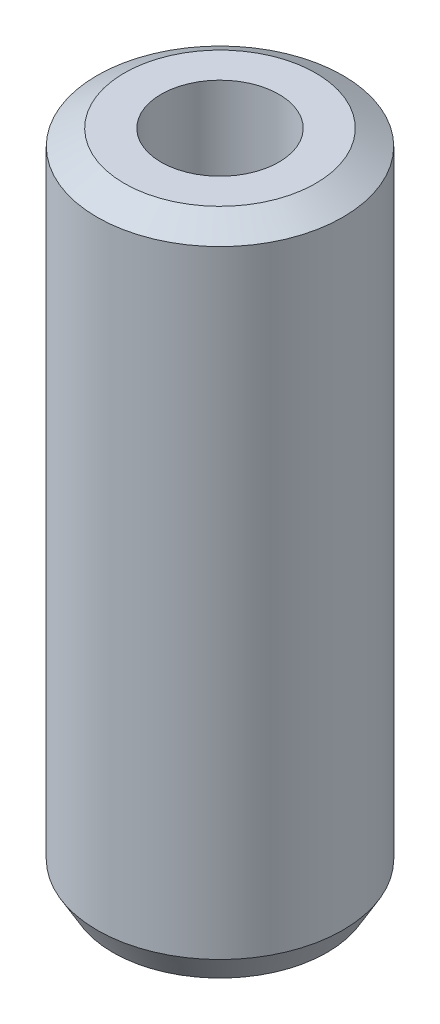
ISO-10303-21;
HEADER;
FILE_DESCRIPTION(('STEP AP214'),'2;1');
FILE_NAME('part.step','',(''),(''),'','','');
FILE_SCHEMA(('AUTOMOTIVE_DESIGN { 1 0 10303 214 1 1 1 1 }'));
ENDSEC;
DATA;
#1=APPLICATION_CONTEXT('core data for automotive mechanical design processes');
#2=APPLICATION_PROTOCOL_DEFINITION('international standard','automotive_design',2000,#1);
#3=PRODUCT_CONTEXT('',#1,'mechanical');
#4=PRODUCT('Part','Part','',(#3));
#5=PRODUCT_RELATED_PRODUCT_CATEGORY('part','',(#4));
#6=PRODUCT_DEFINITION_FORMATION('','',#4);
#7=PRODUCT_DEFINITION_CONTEXT('part definition',#1,'design');
#8=PRODUCT_DEFINITION('design','',#6,#7);
#9=PRODUCT_DEFINITION_SHAPE('','',#8);
#10=(LENGTH_UNIT() NAMED_UNIT(*) SI_UNIT(.MILLI.,.METRE.));
#11=(NAMED_UNIT(*) PLANE_ANGLE_UNIT() SI_UNIT($,.RADIAN.));
#12=(NAMED_UNIT(*) SI_UNIT($,.STERADIAN.) SOLID_ANGLE_UNIT());
#13=UNCERTAINTY_MEASURE_WITH_UNIT(LENGTH_MEASURE(1.E-05),#10,'distance_accuracy_value','');
#14=(GEOMETRIC_REPRESENTATION_CONTEXT(3) GLOBAL_UNCERTAINTY_ASSIGNED_CONTEXT((#13)) GLOBAL_UNIT_ASSIGNED_CONTEXT((#10,
#11,#12)) REPRESENTATION_CONTEXT('',''));
#15=CARTESIAN_POINT('',(0.,0.,0.));
#16=DIRECTION('',(0.,0.,1.));
#17=DIRECTION('',(1.,0.,0.));
#18=AXIS2_PLACEMENT_3D('',#15,#16,#17);
#19=CARTESIAN_POINT('',(0.,214.960547986387,0.));
#20=DIRECTION('',(0.,-1.,0.));
#21=DIRECTION('',(0.,0.,-1.));
#22=AXIS2_PLACEMENT_3D('',#19,#20,#21);
#23=CYLINDRICAL_SURFACE('',#22,40.);
#24=CARTESIAN_POINT('',(0.,209.854898313272,0.));
#25=DIRECTION('',(0.,1.,0.));
#26=DIRECTION('',(0.,0.,1.));
#27=AXIS2_PLACEMENT_3D('',#24,#25,#26);
#28=CIRCLE('',#27,40.);
#29=CARTESIAN_POINT('',(0.,209.854898313272,40.));
#30=VERTEX_POINT('',#29);
#31=EDGE_CURVE('E50',#30,#30,#28,.F.);
#32=ORIENTED_EDGE('',*,*,#31,.T.);
#33=EDGE_LOOP('',(#32));
#34=FACE_BOUND('',#33,.T.);
#35=CARTESIAN_POINT('',(0.,8.84324463948344,0.));
#36=DIRECTION('',(0.,1.,0.));
#37=DIRECTION('',(0.,0.,1.));
#38=AXIS2_PLACEMENT_3D('',#35,#36,#37);
#39=CIRCLE('',#38,40.);
#40=CARTESIAN_POINT('',(0.,8.84324463948344,40.));
#41=VERTEX_POINT('',#40);
#42=EDGE_CURVE('E51',#41,#41,#39,.T.);
#43=ORIENTED_EDGE('',*,*,#42,.T.);
#44=EDGE_LOOP('',(#43));
#45=FACE_BOUND('',#44,.T.);
#46=ADVANCED_FACE('F39',(#34,#45),#23,.T.);
#47=CARTESIAN_POINT('',(0.,214.960547986387,0.));
#48=DIRECTION('',(0.,1.,0.));
#49=DIRECTION('',(0.,0.,1.));
#50=AXIS2_PLACEMENT_3D('',#47,#48,#49);
#51=PLANE('',#50);
#52=CARTESIAN_POINT('',(0.,214.960547986387,0.));
#53=DIRECTION('',(0.,1.,0.));
#54=DIRECTION('',(0.,0.,1.));
#55=AXIS2_PLACEMENT_3D('',#52,#53,#54);
#56=CIRCLE('',#55,31.1567553605167);
#57=CARTESIAN_POINT('',(0.,214.960547986387,31.1567553605167));
#58=VERTEX_POINT('',#57);
#59=EDGE_CURVE('E54',#58,#58,#56,.T.);
#60=ORIENTED_EDGE('',*,*,#59,.T.);
#61=EDGE_LOOP('',(#60));
#62=FACE_BOUND('',#61,.T.);
#63=CARTESIAN_POINT('',(0.,214.960547986387,0.));
#64=DIRECTION('',(0.,1.,0.));
#65=DIRECTION('',(0.,0.,1.));
#66=AXIS2_PLACEMENT_3D('',#63,#64,#65);
#67=CIRCLE('',#66,19.1670382444237);
#68=CARTESIAN_POINT('',(0.,214.960547986387,19.1670382444237));
#69=VERTEX_POINT('',#68);
#70=EDGE_CURVE('E58',#69,#69,#67,.T.);
#71=ORIENTED_EDGE('',*,*,#70,.F.);
#72=EDGE_LOOP('',(#71));
#73=FACE_BOUND('',#72,.T.);
#74=ADVANCED_FACE('F69',(#62,#73),#51,.T.);
#75=CARTESIAN_POINT('',(0.,0.,0.));
#76=DIRECTION('',(0.,1.,0.));
#77=DIRECTION('',(0.,0.,1.));
#78=AXIS2_PLACEMENT_3D('',#75,#76,#77);
#79=PLANE('',#78);
#80=CARTESIAN_POINT('',(0.,0.,0.));
#81=DIRECTION('',(0.,1.,0.));
#82=DIRECTION('',(0.,0.,1.));
#83=AXIS2_PLACEMENT_3D('',#80,#81,#82);
#84=CIRCLE('',#83,34.8943503268845);
#85=CARTESIAN_POINT('',(0.,0.,34.8943503268845));
#86=VERTEX_POINT('',#85);
#87=EDGE_CURVE('E10',#86,#86,#84,.F.);
#88=ORIENTED_EDGE('',*,*,#87,.T.);
#89=EDGE_LOOP('',(#88));
#90=FACE_BOUND('',#89,.T.);
#91=CARTESIAN_POINT('',(0.,0.,0.));
#92=DIRECTION('',(0.,1.,0.));
#93=DIRECTION('',(0.,0.,1.));
#94=AXIS2_PLACEMENT_3D('',#91,#92,#93);
#95=CIRCLE('',#94,19.1670382444237);
#96=CARTESIAN_POINT('',(0.,0.,19.1670382444237));
#97=VERTEX_POINT('',#96);
#98=EDGE_CURVE('E63',#97,#97,#95,.T.);
#99=ORIENTED_EDGE('',*,*,#98,.T.);
#100=EDGE_LOOP('',(#99));
#101=FACE_BOUND('',#100,.T.);
#102=ADVANCED_FACE('F75',(#90,#101),#79,.F.);
#103=CARTESIAN_POINT('',(0.,214.960547986387,0.));
#104=DIRECTION('',(0.,-1.,0.));
#105=DIRECTION('',(0.,0.,-1.));
#106=AXIS2_PLACEMENT_3D('',#103,#104,#105);
#107=CYLINDRICAL_SURFACE('',#106,19.1670382444237);
#108=ORIENTED_EDGE('',*,*,#70,.T.);
#109=EDGE_LOOP('',(#108));
#110=FACE_BOUND('',#109,.T.);
#111=ORIENTED_EDGE('',*,*,#98,.F.);
#112=EDGE_LOOP('',(#111));
#113=FACE_BOUND('',#112,.T.);
#114=ADVANCED_FACE('F70',(#110,#113),#107,.F.);
#115=CARTESIAN_POINT('',(0.,214.960547986387,0.));
#116=DIRECTION('',(0.,-1.,0.));
#117=DIRECTION('',(0.,0.,-1.));
#118=AXIS2_PLACEMENT_3D('',#115,#116,#117);
#119=CONICAL_SURFACE('',#118,31.1567553605167,1.04719755119659);
#120=ORIENTED_EDGE('',*,*,#31,.F.);
#121=EDGE_LOOP('',(#120));
#122=FACE_BOUND('',#121,.T.);
#123=ORIENTED_EDGE('',*,*,#59,.F.);
#124=EDGE_LOOP('',(#123));
#125=FACE_BOUND('',#124,.T.);
#126=ADVANCED_FACE('F81',(#122,#125),#119,.T.);
#127=CARTESIAN_POINT('',(0.,8.84324463948344,0.));
#128=DIRECTION('',(0.,1.,0.));
#129=DIRECTION('',(0.,0.,1.));
#130=AXIS2_PLACEMENT_3D('',#127,#128,#129);
#131=CONICAL_SURFACE('',#130,40.,0.523598775598303);
#132=ORIENTED_EDGE('',*,*,#87,.F.);
#133=EDGE_LOOP('',(#132));
#134=FACE_BOUND('',#133,.T.);
#135=ORIENTED_EDGE('',*,*,#42,.F.);
#136=EDGE_LOOP('',(#135));
#137=FACE_BOUND('',#136,.T.);
#138=ADVANCED_FACE('F45',(#134,#137),#131,.T.);
#139=CLOSED_SHELL('',(#46,#74,#102,#114,#126,#138));
#140=MANIFOLD_SOLID_BREP('B2',#139);
#141=ADVANCED_BREP_SHAPE_REPRESENTATION('',(#18,#140),#14);
#142=SHAPE_DEFINITION_REPRESENTATION(#9,#141);
ENDSEC;
END-ISO-10303-21;
